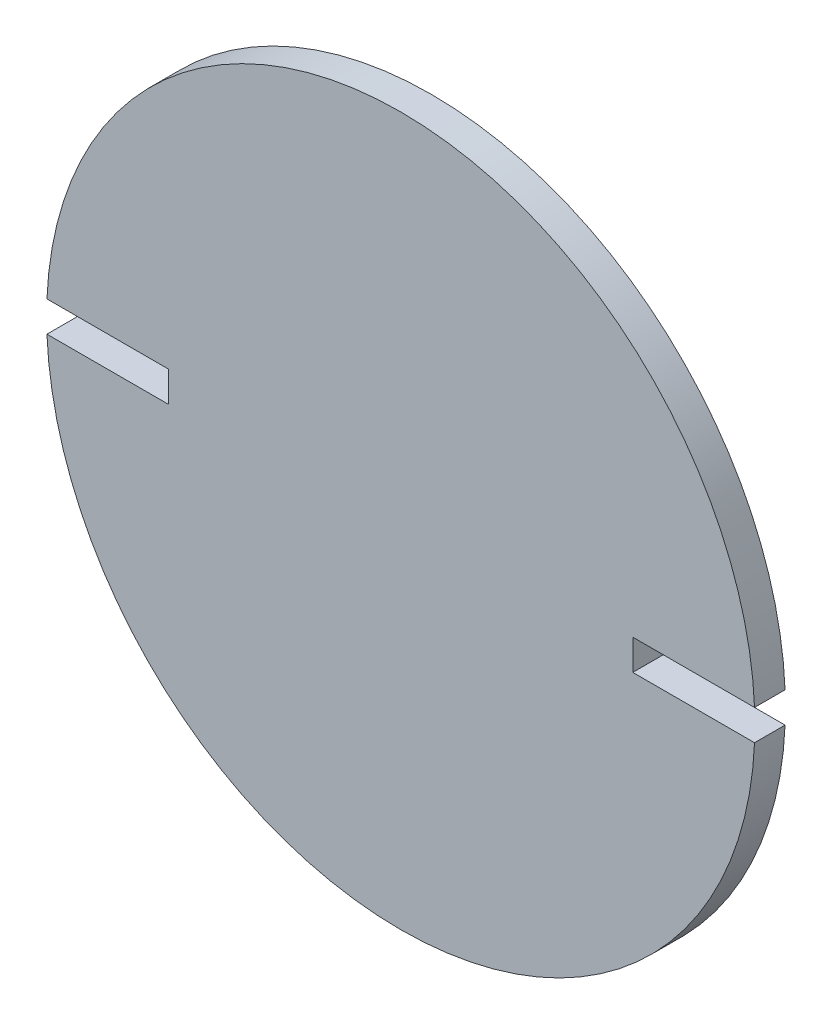
ISO-10303-21;
HEADER;
FILE_DESCRIPTION(('STEP AP214'),'2;1');
FILE_NAME('part.step','',(''),(''),'','','');
FILE_SCHEMA(('AUTOMOTIVE_DESIGN { 1 0 10303 214 1 1 1 1 }'));
ENDSEC;
DATA;
#1=APPLICATION_CONTEXT('core data for automotive mechanical design processes');
#2=APPLICATION_PROTOCOL_DEFINITION('international standard','automotive_design',2000,#1);
#3=PRODUCT_CONTEXT('',#1,'mechanical');
#4=PRODUCT('Part','Part','',(#3));
#5=PRODUCT_RELATED_PRODUCT_CATEGORY('part','',(#4));
#6=PRODUCT_DEFINITION_FORMATION('','',#4);
#7=PRODUCT_DEFINITION_CONTEXT('part definition',#1,'design');
#8=PRODUCT_DEFINITION('design','',#6,#7);
#9=PRODUCT_DEFINITION_SHAPE('','',#8);
#10=(LENGTH_UNIT() NAMED_UNIT(*) SI_UNIT(.MILLI.,.METRE.));
#11=(NAMED_UNIT(*) PLANE_ANGLE_UNIT() SI_UNIT($,.RADIAN.));
#12=(NAMED_UNIT(*) SI_UNIT($,.STERADIAN.) SOLID_ANGLE_UNIT());
#13=UNCERTAINTY_MEASURE_WITH_UNIT(LENGTH_MEASURE(1.E-05),#10,'distance_accuracy_value','');
#14=(GEOMETRIC_REPRESENTATION_CONTEXT(3) GLOBAL_UNCERTAINTY_ASSIGNED_CONTEXT((#13)) GLOBAL_UNIT_ASSIGNED_CONTEXT((#10,
#11,#12)) REPRESENTATION_CONTEXT('',''));
#15=CARTESIAN_POINT('',(0.,0.,0.));
#16=DIRECTION('',(0.,0.,1.));
#17=DIRECTION('',(1.,0.,0.));
#18=AXIS2_PLACEMENT_3D('',#15,#16,#17);
#19=CARTESIAN_POINT('',(0.,0.,6.35));
#20=DIRECTION('',(0.,0.,-1.));
#21=DIRECTION('',(-1.,0.,0.));
#22=AXIS2_PLACEMENT_3D('',#19,#20,#21);
#23=CYLINDRICAL_SURFACE('',#22,73.66);
#24=CARTESIAN_POINT('',(0.,0.,0.));
#25=DIRECTION('',(0.,0.,1.));
#26=DIRECTION('',(1.,0.,0.));
#27=AXIS2_PLACEMENT_3D('',#24,#25,#26);
#28=CIRCLE('',#27,73.66);
#29=CARTESIAN_POINT('',(-73.5915414636764,-3.17499999999999,0.));
#30=VERTEX_POINT('',#29);
#31=CARTESIAN_POINT('',(73.5915414636764,-3.17500000000001,0.));
#32=VERTEX_POINT('',#31);
#33=EDGE_CURVE('E161',#30,#32,#28,.T.);
#34=ORIENTED_EDGE('',*,*,#33,.T.);
#35=DIRECTION('',(0.,0.,-1.));
#36=VECTOR('',#35,1.);
#37=CARTESIAN_POINT('',(73.5915414636764,-3.17500000000001,6.35));
#38=LINE('',#37,#36);
#39=CARTESIAN_POINT('',(73.5915414636764,-3.17500000000001,6.35));
#40=VERTEX_POINT('',#39);
#41=EDGE_CURVE('E158',#32,#40,#38,.F.);
#42=ORIENTED_EDGE('',*,*,#41,.T.);
#43=CARTESIAN_POINT('',(0.,0.,6.35));
#44=DIRECTION('',(0.,0.,1.));
#45=DIRECTION('',(1.,0.,0.));
#46=AXIS2_PLACEMENT_3D('',#43,#44,#45);
#47=CIRCLE('',#46,73.66);
#48=CARTESIAN_POINT('',(-73.5915414636764,-3.17499999999999,6.35));
#49=VERTEX_POINT('',#48);
#50=EDGE_CURVE('E164',#49,#40,#47,.T.);
#51=ORIENTED_EDGE('',*,*,#50,.F.);
#52=DIRECTION('',(0.,0.,-1.));
#53=VECTOR('',#52,1.);
#54=CARTESIAN_POINT('',(-73.5915414636764,-3.17499999999999,6.35));
#55=LINE('',#54,#53);
#56=EDGE_CURVE('E154',#49,#30,#55,.T.);
#57=ORIENTED_EDGE('',*,*,#56,.T.);
#58=EDGE_LOOP('',(#34,#42,#51,#57));
#59=FACE_BOUND('',#58,.T.);
#60=ADVANCED_FACE('F41',(#59),#23,.T.);
#61=CARTESIAN_POINT('',(73.5915414636764,3.17499999999999,6.35));
#62=VERTEX_POINT('',#61);
#63=CARTESIAN_POINT('',(-73.5915414636764,3.17500000000001,6.35));
#64=VERTEX_POINT('',#63);
#65=EDGE_CURVE('E162',#62,#64,#47,.T.);
#66=ORIENTED_EDGE('',*,*,#65,.F.);
#67=DIRECTION('',(0.,0.,-1.));
#68=VECTOR('',#67,1.);
#69=CARTESIAN_POINT('',(73.5915414636764,3.17499999999999,6.35));
#70=LINE('',#69,#68);
#71=CARTESIAN_POINT('',(73.5915414636764,3.17499999999999,0.));
#72=VERTEX_POINT('',#71);
#73=EDGE_CURVE('E120',#62,#72,#70,.T.);
#74=ORIENTED_EDGE('',*,*,#73,.T.);
#75=CARTESIAN_POINT('',(-73.5915414636764,3.17500000000001,0.));
#76=VERTEX_POINT('',#75);
#77=EDGE_CURVE('E165',#72,#76,#28,.T.);
#78=ORIENTED_EDGE('',*,*,#77,.T.);
#79=DIRECTION('',(0.,0.,-1.));
#80=VECTOR('',#79,1.);
#81=CARTESIAN_POINT('',(-73.5915414636764,3.17500000000001,6.35));
#82=LINE('',#81,#80);
#83=EDGE_CURVE('E64',#76,#64,#82,.F.);
#84=ORIENTED_EDGE('',*,*,#83,.T.);
#85=EDGE_LOOP('',(#66,#74,#78,#84));
#86=FACE_BOUND('',#85,.T.);
#87=ADVANCED_FACE('F43',(#86),#23,.T.);
#88=CARTESIAN_POINT('',(0.,0.,6.35));
#89=DIRECTION('',(0.,0.,1.));
#90=DIRECTION('',(1.,0.,0.));
#91=AXIS2_PLACEMENT_3D('',#88,#89,#90);
#92=PLANE('',#91);
#93=DIRECTION('',(-1.,0.,0.));
#94=VECTOR('',#93,1.);
#95=CARTESIAN_POINT('',(76.2,-3.17500000000001,6.35));
#96=LINE('',#95,#94);
#97=CARTESIAN_POINT('',(48.26,-3.17500000000001,6.35));
#98=VERTEX_POINT('',#97);
#99=EDGE_CURVE('E114',#40,#98,#96,.T.);
#100=ORIENTED_EDGE('',*,*,#99,.T.);
#101=DIRECTION('',(0.,1.,0.));
#102=VECTOR('',#101,1.);
#103=CARTESIAN_POINT('',(48.26,-3.17500000000001,6.35));
#104=LINE('',#103,#102);
#105=CARTESIAN_POINT('',(48.26,3.175,6.35));
#106=VERTEX_POINT('',#105);
#107=EDGE_CURVE('E108',#98,#106,#104,.T.);
#108=ORIENTED_EDGE('',*,*,#107,.T.);
#109=DIRECTION('',(1.,0.,0.));
#110=VECTOR('',#109,1.);
#111=CARTESIAN_POINT('',(48.26,3.175,6.35));
#112=LINE('',#111,#110);
#113=EDGE_CURVE('E117',#106,#62,#112,.T.);
#114=ORIENTED_EDGE('',*,*,#113,.T.);
#115=ORIENTED_EDGE('',*,*,#65,.T.);
#116=DIRECTION('',(1.,0.,0.));
#117=VECTOR('',#116,1.);
#118=CARTESIAN_POINT('',(-48.26,3.17500000000001,6.35));
#119=LINE('',#118,#117);
#120=CARTESIAN_POINT('',(-48.26,3.17500000000001,6.35));
#121=VERTEX_POINT('',#120);
#122=EDGE_CURVE('E148',#64,#121,#119,.T.);
#123=ORIENTED_EDGE('',*,*,#122,.T.);
#124=DIRECTION('',(0.,-1.,0.));
#125=VECTOR('',#124,1.);
#126=CARTESIAN_POINT('',(-48.26,0.,6.35));
#127=LINE('',#126,#125);
#128=CARTESIAN_POINT('',(-48.26,-3.175,6.35));
#129=VERTEX_POINT('',#128);
#130=EDGE_CURVE('E138',#121,#129,#127,.T.);
#131=ORIENTED_EDGE('',*,*,#130,.T.);
#132=DIRECTION('',(-1.,0.,0.));
#133=VECTOR('',#132,1.);
#134=CARTESIAN_POINT('',(-76.2,-3.17499999999999,6.35));
#135=LINE('',#134,#133);
#136=EDGE_CURVE('E144',#129,#49,#135,.T.);
#137=ORIENTED_EDGE('',*,*,#136,.T.);
#138=ORIENTED_EDGE('',*,*,#50,.T.);
#139=EDGE_LOOP('',(#100,#108,#114,#115,#123,#131,#137,#138));
#140=FACE_BOUND('',#139,.T.);
#141=ADVANCED_FACE('F125',(#140),#92,.T.);
#142=CARTESIAN_POINT('',(0.,0.,0.));
#143=DIRECTION('',(0.,0.,1.));
#144=DIRECTION('',(1.,0.,0.));
#145=AXIS2_PLACEMENT_3D('',#142,#143,#144);
#146=PLANE('',#145);
#147=DIRECTION('',(0.,1.,0.));
#148=VECTOR('',#147,1.);
#149=CARTESIAN_POINT('',(48.26,0.,0.));
#150=LINE('',#149,#148);
#151=CARTESIAN_POINT('',(48.26,-3.17500000000001,0.));
#152=VERTEX_POINT('',#151);
#153=CARTESIAN_POINT('',(48.26,3.175,0.));
#154=VERTEX_POINT('',#153);
#155=EDGE_CURVE('E111',#152,#154,#150,.T.);
#156=ORIENTED_EDGE('',*,*,#155,.F.);
#157=DIRECTION('',(1.,0.,0.));
#158=VECTOR('',#157,1.);
#159=CARTESIAN_POINT('',(0.,-3.17500000000001,0.));
#160=LINE('',#159,#158);
#161=EDGE_CURVE('E11',#152,#32,#160,.T.);
#162=ORIENTED_EDGE('',*,*,#161,.T.);
#163=ORIENTED_EDGE('',*,*,#33,.F.);
#164=DIRECTION('',(-1.,0.,0.));
#165=VECTOR('',#164,1.);
#166=CARTESIAN_POINT('',(-76.2,-3.17499999999999,0.));
#167=LINE('',#166,#165);
#168=CARTESIAN_POINT('',(-48.26,-3.175,0.));
#169=VERTEX_POINT('',#168);
#170=EDGE_CURVE('E132',#169,#30,#167,.T.);
#171=ORIENTED_EDGE('',*,*,#170,.F.);
#172=DIRECTION('',(0.,-1.,0.));
#173=VECTOR('',#172,1.);
#174=CARTESIAN_POINT('',(-48.26,-3.175,0.));
#175=LINE('',#174,#173);
#176=CARTESIAN_POINT('',(-48.26,3.17500000000001,0.));
#177=VERTEX_POINT('',#176);
#178=EDGE_CURVE('E141',#177,#169,#175,.T.);
#179=ORIENTED_EDGE('',*,*,#178,.F.);
#180=DIRECTION('',(-1.,0.,0.));
#181=VECTOR('',#180,1.);
#182=CARTESIAN_POINT('',(0.,3.175,0.));
#183=LINE('',#182,#181);
#184=EDGE_CURVE('E49',#177,#76,#183,.T.);
#185=ORIENTED_EDGE('',*,*,#184,.T.);
#186=ORIENTED_EDGE('',*,*,#77,.F.);
#187=DIRECTION('',(1.,0.,0.));
#188=VECTOR('',#187,1.);
#189=CARTESIAN_POINT('',(48.26,3.175,0.));
#190=LINE('',#189,#188);
#191=EDGE_CURVE('E127',#154,#72,#190,.T.);
#192=ORIENTED_EDGE('',*,*,#191,.F.);
#193=EDGE_LOOP('',(#156,#162,#163,#171,#179,#185,#186,#192));
#194=FACE_BOUND('',#193,.T.);
#195=ADVANCED_FACE('F170',(#194),#146,.F.);
#196=CARTESIAN_POINT('',(-76.2,-3.17499999999999,6.35));
#197=DIRECTION('',(0.,-1.,0.));
#198=DIRECTION('',(1.,0.,0.));
#199=AXIS2_PLACEMENT_3D('',#196,#197,#198);
#200=PLANE('',#199);
#201=ORIENTED_EDGE('',*,*,#136,.F.);
#202=DIRECTION('',(0.,0.,-1.));
#203=VECTOR('',#202,1.);
#204=CARTESIAN_POINT('',(-48.26,-3.175,6.35));
#205=LINE('',#204,#203);
#206=EDGE_CURVE('E139',#129,#169,#205,.T.);
#207=ORIENTED_EDGE('',*,*,#206,.T.);
#208=ORIENTED_EDGE('',*,*,#170,.T.);
#209=ORIENTED_EDGE('',*,*,#56,.F.);
#210=EDGE_LOOP('',(#201,#207,#208,#209));
#211=FACE_BOUND('',#210,.T.);
#212=ADVANCED_FACE('F179',(#211),#200,.F.);
#213=CARTESIAN_POINT('',(-48.26,3.17500000000001,6.35));
#214=DIRECTION('',(0.,1.,0.));
#215=DIRECTION('',(-1.,0.,0.));
#216=AXIS2_PLACEMENT_3D('',#213,#214,#215);
#217=PLANE('',#216);
#218=ORIENTED_EDGE('',*,*,#184,.F.);
#219=DIRECTION('',(0.,0.,-1.));
#220=VECTOR('',#219,1.);
#221=CARTESIAN_POINT('',(-48.26,3.17500000000001,6.35));
#222=LINE('',#221,#220);
#223=EDGE_CURVE('E135',#121,#177,#222,.T.);
#224=ORIENTED_EDGE('',*,*,#223,.F.);
#225=ORIENTED_EDGE('',*,*,#122,.F.);
#226=ORIENTED_EDGE('',*,*,#83,.F.);
#227=EDGE_LOOP('',(#218,#224,#225,#226));
#228=FACE_BOUND('',#227,.T.);
#229=ADVANCED_FACE('F174',(#228),#217,.F.);
#230=CARTESIAN_POINT('',(-48.26,-3.175,6.35));
#231=DIRECTION('',(1.,0.,0.));
#232=DIRECTION('',(0.,0.,-1.));
#233=AXIS2_PLACEMENT_3D('',#230,#231,#232);
#234=PLANE('',#233);
#235=ORIENTED_EDGE('',*,*,#178,.T.);
#236=ORIENTED_EDGE('',*,*,#206,.F.);
#237=ORIENTED_EDGE('',*,*,#130,.F.);
#238=ORIENTED_EDGE('',*,*,#223,.T.);
#239=EDGE_LOOP('',(#235,#236,#237,#238));
#240=FACE_BOUND('',#239,.T.);
#241=ADVANCED_FACE('F176',(#240),#234,.F.);
#242=CARTESIAN_POINT('',(76.2,-3.17500000000001,6.35));
#243=DIRECTION('',(0.,-1.,0.));
#244=DIRECTION('',(0.,0.,-1.));
#245=AXIS2_PLACEMENT_3D('',#242,#243,#244);
#246=PLANE('',#245);
#247=ORIENTED_EDGE('',*,*,#161,.F.);
#248=DIRECTION('',(0.,0.,-1.));
#249=VECTOR('',#248,1.);
#250=CARTESIAN_POINT('',(48.26,-3.17500000000001,6.35));
#251=LINE('',#250,#249);
#252=EDGE_CURVE('E56',#98,#152,#251,.T.);
#253=ORIENTED_EDGE('',*,*,#252,.F.);
#254=ORIENTED_EDGE('',*,*,#99,.F.);
#255=ORIENTED_EDGE('',*,*,#41,.F.);
#256=EDGE_LOOP('',(#247,#253,#254,#255));
#257=FACE_BOUND('',#256,.T.);
#258=ADVANCED_FACE('F185',(#257),#246,.F.);
#259=CARTESIAN_POINT('',(48.26,3.175,6.35));
#260=DIRECTION('',(0.,1.,0.));
#261=DIRECTION('',(-1.,0.,0.));
#262=AXIS2_PLACEMENT_3D('',#259,#260,#261);
#263=PLANE('',#262);
#264=ORIENTED_EDGE('',*,*,#113,.F.);
#265=DIRECTION('',(0.,0.,-1.));
#266=VECTOR('',#265,1.);
#267=CARTESIAN_POINT('',(48.26,3.175,6.35));
#268=LINE('',#267,#266);
#269=EDGE_CURVE('E104',#106,#154,#268,.T.);
#270=ORIENTED_EDGE('',*,*,#269,.T.);
#271=ORIENTED_EDGE('',*,*,#191,.T.);
#272=ORIENTED_EDGE('',*,*,#73,.F.);
#273=EDGE_LOOP('',(#264,#270,#271,#272));
#274=FACE_BOUND('',#273,.T.);
#275=ADVANCED_FACE('F118',(#274),#263,.F.);
#276=CARTESIAN_POINT('',(48.26,0.,6.35));
#277=DIRECTION('',(-1.,0.,0.));
#278=DIRECTION('',(0.,0.,1.));
#279=AXIS2_PLACEMENT_3D('',#276,#277,#278);
#280=PLANE('',#279);
#281=ORIENTED_EDGE('',*,*,#155,.T.);
#282=ORIENTED_EDGE('',*,*,#269,.F.);
#283=ORIENTED_EDGE('',*,*,#107,.F.);
#284=ORIENTED_EDGE('',*,*,#252,.T.);
#285=EDGE_LOOP('',(#281,#282,#283,#284));
#286=FACE_BOUND('',#285,.T.);
#287=ADVANCED_FACE('F106',(#286),#280,.F.);
#288=CLOSED_SHELL('',(#60,#87,#141,#195,#212,#229,#241,#258,#275,#287));
#289=MANIFOLD_SOLID_BREP('B2',#288);
#290=ADVANCED_BREP_SHAPE_REPRESENTATION('',(#18,#289),#14);
#291=SHAPE_DEFINITION_REPRESENTATION(#9,#290);
ENDSEC;
END-ISO-10303-21;
